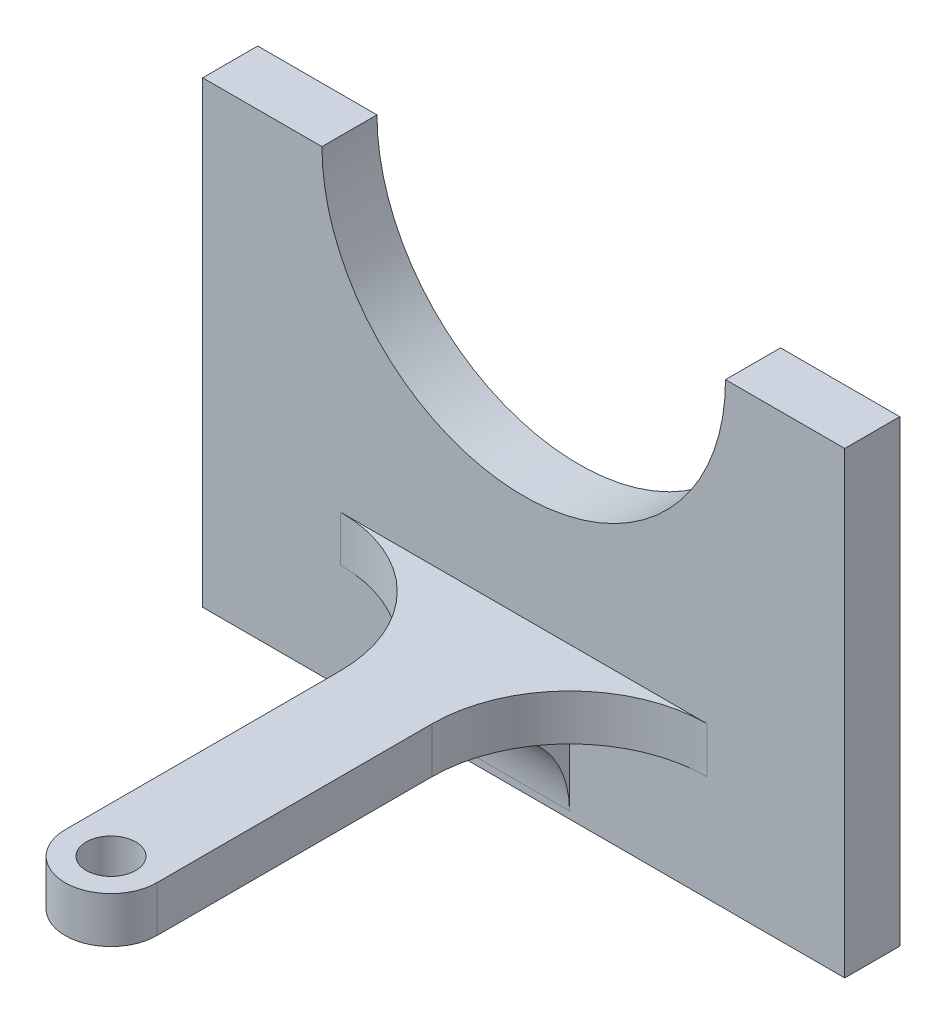
ISO-10303-21;
HEADER;
FILE_DESCRIPTION(('STEP AP214'),'2;1');
FILE_NAME('part.step','',(''),(''),'','','');
FILE_SCHEMA(('AUTOMOTIVE_DESIGN { 1 0 10303 214 1 1 1 1 }'));
ENDSEC;
DATA;
#1=APPLICATION_CONTEXT('core data for automotive mechanical design processes');
#2=APPLICATION_PROTOCOL_DEFINITION('international standard','automotive_design',2000,#1);
#3=PRODUCT_CONTEXT('',#1,'mechanical');
#4=PRODUCT('Part','Part','',(#3));
#5=PRODUCT_RELATED_PRODUCT_CATEGORY('part','',(#4));
#6=PRODUCT_DEFINITION_FORMATION('','',#4);
#7=PRODUCT_DEFINITION_CONTEXT('part definition',#1,'design');
#8=PRODUCT_DEFINITION('design','',#6,#7);
#9=PRODUCT_DEFINITION_SHAPE('','',#8);
#10=(LENGTH_UNIT() NAMED_UNIT(*) SI_UNIT(.MILLI.,.METRE.));
#11=(NAMED_UNIT(*) PLANE_ANGLE_UNIT() SI_UNIT($,.RADIAN.));
#12=(NAMED_UNIT(*) SI_UNIT($,.STERADIAN.) SOLID_ANGLE_UNIT());
#13=UNCERTAINTY_MEASURE_WITH_UNIT(LENGTH_MEASURE(1.E-05),#10,'distance_accuracy_value','');
#14=(GEOMETRIC_REPRESENTATION_CONTEXT(3) GLOBAL_UNCERTAINTY_ASSIGNED_CONTEXT((#13)) GLOBAL_UNIT_ASSIGNED_CONTEXT((#10,
#11,#12)) REPRESENTATION_CONTEXT('',''));
#15=CARTESIAN_POINT('',(0.,0.,0.));
#16=DIRECTION('',(0.,0.,1.));
#17=DIRECTION('',(1.,0.,0.));
#18=AXIS2_PLACEMENT_3D('',#15,#16,#17);
#19=CARTESIAN_POINT('',(0.,0.,4.));
#20=DIRECTION('',(0.,0.,1.));
#21=DIRECTION('',(1.,0.,0.));
#22=AXIS2_PLACEMENT_3D('',#19,#20,#21);
#23=PLANE('',#22);
#24=CARTESIAN_POINT('',(0.,25.,4.));
#25=DIRECTION('',(0.,0.,1.));
#26=DIRECTION('',(1.,0.,0.));
#27=AXIS2_PLACEMENT_3D('',#24,#25,#26);
#28=CIRCLE('',#27,22.);
#29=CARTESIAN_POINT('',(-22.,25.,4.));
#30=VERTEX_POINT('',#29);
#31=CARTESIAN_POINT('',(22.,25.,4.));
#32=VERTEX_POINT('',#31);
#33=EDGE_CURVE('E213',#30,#32,#28,.T.);
#34=ORIENTED_EDGE('',*,*,#33,.F.);
#35=DIRECTION('',(-1.,0.,0.));
#36=VECTOR('',#35,1.);
#37=CARTESIAN_POINT('',(0.,25.,4.));
#38=LINE('',#37,#36);
#39=CARTESIAN_POINT('',(-35.,25.,4.));
#40=VERTEX_POINT('',#39);
#41=EDGE_CURVE('E216',#30,#40,#38,.T.);
#42=ORIENTED_EDGE('',*,*,#41,.T.);
#43=DIRECTION('',(0.,1.,0.));
#44=VECTOR('',#43,1.);
#45=CARTESIAN_POINT('',(-35.,0.,4.));
#46=LINE('',#45,#44);
#47=CARTESIAN_POINT('',(-35.,-25.,4.));
#48=VERTEX_POINT('',#47);
#49=EDGE_CURVE('E219',#48,#40,#46,.T.);
#50=ORIENTED_EDGE('',*,*,#49,.F.);
#51=DIRECTION('',(-1.,0.,0.));
#52=VECTOR('',#51,1.);
#53=CARTESIAN_POINT('',(0.,-25.,4.));
#54=LINE('',#53,#52);
#55=CARTESIAN_POINT('',(35.,-25.,4.));
#56=VERTEX_POINT('',#55);
#57=EDGE_CURVE('E223',#56,#48,#54,.T.);
#58=ORIENTED_EDGE('',*,*,#57,.F.);
#59=DIRECTION('',(0.,1.,0.));
#60=VECTOR('',#59,1.);
#61=CARTESIAN_POINT('',(35.,0.,4.));
#62=LINE('',#61,#60);
#63=CARTESIAN_POINT('',(35.,25.,4.));
#64=VERTEX_POINT('',#63);
#65=EDGE_CURVE('E226',#56,#64,#62,.T.);
#66=ORIENTED_EDGE('',*,*,#65,.T.);
#67=EDGE_CURVE('E220',#64,#32,#38,.T.);
#68=ORIENTED_EDGE('',*,*,#67,.T.);
#69=EDGE_LOOP('',(#34,#42,#50,#58,#66,#68));
#70=FACE_BOUND('',#69,.T.);
#71=DIRECTION('',(1.,0.,0.));
#72=VECTOR('',#71,1.);
#73=CARTESIAN_POINT('',(-5.,-24.2336891325278,4.));
#74=LINE('',#73,#72);
#75=CARTESIAN_POINT('',(-5.,-24.2336891325278,4.));
#76=VERTEX_POINT('',#75);
#77=CARTESIAN_POINT('',(5.,-24.2336891325278,4.));
#78=VERTEX_POINT('',#77);
#79=EDGE_CURVE('E147',#76,#78,#74,.T.);
#80=ORIENTED_EDGE('',*,*,#79,.F.);
#81=DIRECTION('',(0.,-1.,0.));
#82=VECTOR('',#81,1.);
#83=CARTESIAN_POINT('',(-5.,0.,4.));
#84=LINE('',#83,#82);
#85=CARTESIAN_POINT('',(-5.,-13.5,4.));
#86=VERTEX_POINT('',#85);
#87=EDGE_CURVE('E168',#86,#76,#84,.T.);
#88=ORIENTED_EDGE('',*,*,#87,.F.);
#89=DIRECTION('',(1.,0.,0.));
#90=VECTOR('',#89,1.);
#91=CARTESIAN_POINT('',(5.,-13.5,4.));
#92=LINE('',#91,#90);
#93=CARTESIAN_POINT('',(-20.,-13.5,4.));
#94=VERTEX_POINT('',#93);
#95=EDGE_CURVE('E198',#94,#86,#92,.T.);
#96=ORIENTED_EDGE('',*,*,#95,.F.);
#97=DIRECTION('',(0.,-1.,0.));
#98=VECTOR('',#97,1.);
#99=CARTESIAN_POINT('',(-20.,-8.5,4.));
#100=LINE('',#99,#98);
#101=CARTESIAN_POINT('',(-20.,-8.5,4.));
#102=VERTEX_POINT('',#101);
#103=EDGE_CURVE('E179',#102,#94,#100,.T.);
#104=ORIENTED_EDGE('',*,*,#103,.F.);
#105=DIRECTION('',(-1.,0.,0.));
#106=VECTOR('',#105,1.);
#107=CARTESIAN_POINT('',(5.,-8.5,4.));
#108=LINE('',#107,#106);
#109=CARTESIAN_POINT('',(20.,-8.5,4.));
#110=VERTEX_POINT('',#109);
#111=EDGE_CURVE('E61',#110,#102,#108,.T.);
#112=ORIENTED_EDGE('',*,*,#111,.F.);
#113=DIRECTION('',(0.,-1.,0.));
#114=VECTOR('',#113,1.);
#115=CARTESIAN_POINT('',(20.,-8.5,4.));
#116=LINE('',#115,#114);
#117=CARTESIAN_POINT('',(20.,-13.5,4.));
#118=VERTEX_POINT('',#117);
#119=EDGE_CURVE('E186',#110,#118,#116,.T.);
#120=ORIENTED_EDGE('',*,*,#119,.T.);
#121=CARTESIAN_POINT('',(5.,-13.5,4.));
#122=VERTEX_POINT('',#121);
#123=EDGE_CURVE('E163',#122,#118,#92,.T.);
#124=ORIENTED_EDGE('',*,*,#123,.F.);
#125=DIRECTION('',(0.,-1.,0.));
#126=VECTOR('',#125,1.);
#127=CARTESIAN_POINT('',(5.,0.,4.));
#128=LINE('',#127,#126);
#129=EDGE_CURVE('E53',#122,#78,#128,.T.);
#130=ORIENTED_EDGE('',*,*,#129,.T.);
#131=EDGE_LOOP('',(#80,#88,#96,#104,#112,#120,#124,#130));
#132=FACE_BOUND('',#131,.T.);
#133=ADVANCED_FACE('F37',(#70,#132),#23,.T.);
#134=CARTESIAN_POINT('',(5.,-13.5,54.));
#135=DIRECTION('',(0.,1.,0.));
#136=DIRECTION('',(0.,0.,1.));
#137=AXIS2_PLACEMENT_3D('',#134,#135,#136);
#138=PLANE('',#137);
#139=CARTESIAN_POINT('',(0.,-13.5,49.));
#140=DIRECTION('',(0.,1.,0.));
#141=DIRECTION('',(0.,0.,1.));
#142=AXIS2_PLACEMENT_3D('',#139,#140,#141);
#143=CIRCLE('',#142,2.7);
#144=CARTESIAN_POINT('',(0.,-13.5,51.7));
#145=VERTEX_POINT('',#144);
#146=EDGE_CURVE('E195',#145,#145,#143,.T.);
#147=ORIENTED_EDGE('',*,*,#146,.T.);
#148=EDGE_LOOP('',(#147));
#149=FACE_BOUND('',#148,.T.);
#150=DIRECTION('',(0.,0.,-1.));
#151=VECTOR('',#150,1.);
#152=CARTESIAN_POINT('',(-5.,-13.5,0.));
#153=LINE('',#152,#151);
#154=CARTESIAN_POINT('',(-5.,-13.5,13.1902442393469));
#155=VERTEX_POINT('',#154);
#156=EDGE_CURVE('E155',#155,#86,#153,.T.);
#157=ORIENTED_EDGE('',*,*,#156,.F.);
#158=DIRECTION('',(1.,0.,0.));
#159=VECTOR('',#158,1.);
#160=CARTESIAN_POINT('',(-5.,-13.5,13.1902442393469));
#161=LINE('',#160,#159);
#162=CARTESIAN_POINT('',(5.,-13.5,13.1902442393469));
#163=VERTEX_POINT('',#162);
#164=EDGE_CURVE('E154',#155,#163,#161,.T.);
#165=ORIENTED_EDGE('',*,*,#164,.T.);
#166=DIRECTION('',(0.,0.,-1.));
#167=VECTOR('',#166,1.);
#168=CARTESIAN_POINT('',(5.,-13.5,0.));
#169=LINE('',#168,#167);
#170=EDGE_CURVE('E158',#163,#122,#169,.T.);
#171=ORIENTED_EDGE('',*,*,#170,.T.);
#172=ORIENTED_EDGE('',*,*,#123,.T.);
#173=CARTESIAN_POINT('',(20.,-13.5,19.));
#174=DIRECTION('',(0.,1.,0.));
#175=DIRECTION('',(0.,0.,1.));
#176=AXIS2_PLACEMENT_3D('',#173,#174,#175);
#177=CIRCLE('',#176,15.);
#178=CARTESIAN_POINT('',(5.,-13.5,19.));
#179=VERTEX_POINT('',#178);
#180=EDGE_CURVE('E182',#118,#179,#177,.T.);
#181=ORIENTED_EDGE('',*,*,#180,.T.);
#182=DIRECTION('',(0.,0.,-1.));
#183=VECTOR('',#182,1.);
#184=CARTESIAN_POINT('',(5.,-13.5,54.));
#185=LINE('',#184,#183);
#186=CARTESIAN_POINT('',(5.,-13.5,49.));
#187=VERTEX_POINT('',#186);
#188=EDGE_CURVE('E207',#187,#179,#185,.T.);
#189=ORIENTED_EDGE('',*,*,#188,.F.);
#190=CARTESIAN_POINT('',(0.,-13.5,49.));
#191=DIRECTION('',(0.,1.,0.));
#192=DIRECTION('',(0.,0.,1.));
#193=AXIS2_PLACEMENT_3D('',#190,#191,#192);
#194=CIRCLE('',#193,5.);
#195=CARTESIAN_POINT('',(-5.,-13.5,49.));
#196=VERTEX_POINT('',#195);
#197=EDGE_CURVE('E11',#187,#196,#194,.F.);
#198=ORIENTED_EDGE('',*,*,#197,.T.);
#199=DIRECTION('',(0.,0.,-1.));
#200=VECTOR('',#199,1.);
#201=CARTESIAN_POINT('',(-5.,-13.5,54.));
#202=LINE('',#201,#200);
#203=CARTESIAN_POINT('',(-5.,-13.5,19.));
#204=VERTEX_POINT('',#203);
#205=EDGE_CURVE('E210',#196,#204,#202,.T.);
#206=ORIENTED_EDGE('',*,*,#205,.T.);
#207=CARTESIAN_POINT('',(-20.,-13.5,19.));
#208=DIRECTION('',(0.,1.,0.));
#209=DIRECTION('',(0.,0.,-1.));
#210=AXIS2_PLACEMENT_3D('',#207,#208,#209);
#211=CIRCLE('',#210,15.);
#212=EDGE_CURVE('E171',#204,#94,#211,.T.);
#213=ORIENTED_EDGE('',*,*,#212,.T.);
#214=ORIENTED_EDGE('',*,*,#95,.T.);
#215=EDGE_LOOP('',(#157,#165,#171,#172,#181,#189,#198,#206,#213,#214));
#216=FACE_BOUND('',#215,.T.);
#217=ADVANCED_FACE('F275',(#149,#216),#138,.F.);
#218=CARTESIAN_POINT('',(-5.,-8.5,54.));
#219=DIRECTION('',(1.,0.,0.));
#220=DIRECTION('',(0.,0.,-1.));
#221=AXIS2_PLACEMENT_3D('',#218,#219,#220);
#222=PLANE('',#221);
#223=DIRECTION('',(0.,-1.,0.));
#224=VECTOR('',#223,1.);
#225=CARTESIAN_POINT('',(-5.,-8.5,19.));
#226=LINE('',#225,#224);
#227=CARTESIAN_POINT('',(-5.,-8.5,19.));
#228=VERTEX_POINT('',#227);
#229=EDGE_CURVE('E176',#228,#204,#226,.T.);
#230=ORIENTED_EDGE('',*,*,#229,.T.);
#231=ORIENTED_EDGE('',*,*,#205,.F.);
#232=DIRECTION('',(0.,1.,0.));
#233=VECTOR('',#232,1.);
#234=CARTESIAN_POINT('',(-5.,-8.5,49.));
#235=LINE('',#234,#233);
#236=CARTESIAN_POINT('',(-5.,-8.5,49.));
#237=VERTEX_POINT('',#236);
#238=EDGE_CURVE('E257',#196,#237,#235,.T.);
#239=ORIENTED_EDGE('',*,*,#238,.T.);
#240=DIRECTION('',(0.,0.,-1.));
#241=VECTOR('',#240,1.);
#242=CARTESIAN_POINT('',(-5.,-8.5,54.));
#243=LINE('',#242,#241);
#244=EDGE_CURVE('E202',#237,#228,#243,.T.);
#245=ORIENTED_EDGE('',*,*,#244,.T.);
#246=EDGE_LOOP('',(#230,#231,#239,#245));
#247=FACE_BOUND('',#246,.T.);
#248=ADVANCED_FACE('F284',(#247),#222,.F.);
#249=CARTESIAN_POINT('',(0.,-8.5,49.));
#250=DIRECTION('',(0.,1.,0.));
#251=DIRECTION('',(-1.,0.,0.));
#252=AXIS2_PLACEMENT_3D('',#249,#250,#251);
#253=CYLINDRICAL_SURFACE('',#252,5.);
#254=DIRECTION('',(0.,1.,0.));
#255=VECTOR('',#254,1.);
#256=CARTESIAN_POINT('',(5.,-8.5,49.));
#257=LINE('',#256,#255);
#258=CARTESIAN_POINT('',(5.,-8.5,49.));
#259=VERTEX_POINT('',#258);
#260=EDGE_CURVE('E244',#259,#187,#257,.F.);
#261=ORIENTED_EDGE('',*,*,#260,.F.);
#262=CARTESIAN_POINT('',(0.,-8.5,49.));
#263=DIRECTION('',(0.,-1.,0.));
#264=DIRECTION('',(0.,0.,-1.));
#265=AXIS2_PLACEMENT_3D('',#262,#263,#264);
#266=CIRCLE('',#265,5.);
#267=EDGE_CURVE('E46',#237,#259,#266,.F.);
#268=ORIENTED_EDGE('',*,*,#267,.F.);
#269=ORIENTED_EDGE('',*,*,#238,.F.);
#270=ORIENTED_EDGE('',*,*,#197,.F.);
#271=EDGE_LOOP('',(#261,#268,#269,#270));
#272=FACE_BOUND('',#271,.T.);
#273=ADVANCED_FACE('F40',(#272),#253,.T.);
#274=CARTESIAN_POINT('',(0.,25.,-2.));
#275=DIRECTION('',(0.,0.,1.));
#276=DIRECTION('',(1.,0.,0.));
#277=AXIS2_PLACEMENT_3D('',#274,#275,#276);
#278=CYLINDRICAL_SURFACE('',#277,22.);
#279=DIRECTION('',(0.,0.,1.));
#280=VECTOR('',#279,1.);
#281=CARTESIAN_POINT('',(-22.,25.,-2.));
#282=LINE('',#281,#280);
#283=CARTESIAN_POINT('',(-22.,25.,-2.));
#284=VERTEX_POINT('',#283);
#285=EDGE_CURVE('E253',#284,#30,#282,.T.);
#286=ORIENTED_EDGE('',*,*,#285,.T.);
#287=ORIENTED_EDGE('',*,*,#33,.T.);
#288=DIRECTION('',(0.,0.,1.));
#289=VECTOR('',#288,1.);
#290=CARTESIAN_POINT('',(22.,25.,-2.));
#291=LINE('',#290,#289);
#292=CARTESIAN_POINT('',(22.,25.,-2.));
#293=VERTEX_POINT('',#292);
#294=EDGE_CURVE('E242',#293,#32,#291,.T.);
#295=ORIENTED_EDGE('',*,*,#294,.F.);
#296=CARTESIAN_POINT('',(0.,25.,-2.));
#297=DIRECTION('',(0.,0.,1.));
#298=DIRECTION('',(1.,0.,0.));
#299=AXIS2_PLACEMENT_3D('',#296,#297,#298);
#300=CIRCLE('',#299,22.);
#301=EDGE_CURVE('E229',#284,#293,#300,.T.);
#302=ORIENTED_EDGE('',*,*,#301,.F.);
#303=EDGE_LOOP('',(#286,#287,#295,#302));
#304=FACE_BOUND('',#303,.T.);
#305=ADVANCED_FACE('F291',(#304),#278,.F.);
#306=CARTESIAN_POINT('',(0.,25.,-2.));
#307=DIRECTION('',(0.,1.,0.));
#308=DIRECTION('',(0.,0.,1.));
#309=AXIS2_PLACEMENT_3D('',#306,#307,#308);
#310=PLANE('',#309);
#311=ORIENTED_EDGE('',*,*,#294,.T.);
#312=ORIENTED_EDGE('',*,*,#67,.F.);
#313=DIRECTION('',(0.,0.,1.));
#314=VECTOR('',#313,1.);
#315=CARTESIAN_POINT('',(35.,25.,-2.));
#316=LINE('',#315,#314);
#317=CARTESIAN_POINT('',(35.,25.,-2.));
#318=VERTEX_POINT('',#317);
#319=EDGE_CURVE('E245',#318,#64,#316,.T.);
#320=ORIENTED_EDGE('',*,*,#319,.F.);
#321=DIRECTION('',(-1.,0.,0.));
#322=VECTOR('',#321,1.);
#323=CARTESIAN_POINT('',(0.,25.,-2.));
#324=LINE('',#323,#322);
#325=EDGE_CURVE('E235',#318,#293,#324,.T.);
#326=ORIENTED_EDGE('',*,*,#325,.T.);
#327=EDGE_LOOP('',(#311,#312,#320,#326));
#328=FACE_BOUND('',#327,.T.);
#329=ADVANCED_FACE('F306',(#328),#310,.T.);
#330=CARTESIAN_POINT('',(35.,0.,-2.));
#331=DIRECTION('',(1.,0.,0.));
#332=DIRECTION('',(0.,0.,-1.));
#333=AXIS2_PLACEMENT_3D('',#330,#331,#332);
#334=PLANE('',#333);
#335=ORIENTED_EDGE('',*,*,#319,.T.);
#336=ORIENTED_EDGE('',*,*,#65,.F.);
#337=DIRECTION('',(0.,0.,1.));
#338=VECTOR('',#337,1.);
#339=CARTESIAN_POINT('',(35.,-25.,-2.));
#340=LINE('',#339,#338);
#341=CARTESIAN_POINT('',(35.,-25.,-2.));
#342=VERTEX_POINT('',#341);
#343=EDGE_CURVE('E247',#342,#56,#340,.T.);
#344=ORIENTED_EDGE('',*,*,#343,.F.);
#345=DIRECTION('',(0.,1.,0.));
#346=VECTOR('',#345,1.);
#347=CARTESIAN_POINT('',(35.,0.,-2.));
#348=LINE('',#347,#346);
#349=EDGE_CURVE('E239',#342,#318,#348,.T.);
#350=ORIENTED_EDGE('',*,*,#349,.T.);
#351=EDGE_LOOP('',(#335,#336,#344,#350));
#352=FACE_BOUND('',#351,.T.);
#353=ADVANCED_FACE('F309',(#352),#334,.T.);
#354=CARTESIAN_POINT('',(0.,-25.,-2.));
#355=DIRECTION('',(0.,1.,0.));
#356=DIRECTION('',(-1.,0.,0.));
#357=AXIS2_PLACEMENT_3D('',#354,#355,#356);
#358=PLANE('',#357);
#359=ORIENTED_EDGE('',*,*,#343,.T.);
#360=ORIENTED_EDGE('',*,*,#57,.T.);
#361=DIRECTION('',(0.,0.,1.));
#362=VECTOR('',#361,1.);
#363=CARTESIAN_POINT('',(-35.,-25.,-2.));
#364=LINE('',#363,#362);
#365=CARTESIAN_POINT('',(-35.,-25.,-2.));
#366=VERTEX_POINT('',#365);
#367=EDGE_CURVE('E249',#366,#48,#364,.T.);
#368=ORIENTED_EDGE('',*,*,#367,.F.);
#369=DIRECTION('',(-1.,0.,0.));
#370=VECTOR('',#369,1.);
#371=CARTESIAN_POINT('',(0.,-25.,-2.));
#372=LINE('',#371,#370);
#373=EDGE_CURVE('E237',#342,#366,#372,.T.);
#374=ORIENTED_EDGE('',*,*,#373,.F.);
#375=EDGE_LOOP('',(#359,#360,#368,#374));
#376=FACE_BOUND('',#375,.T.);
#377=ADVANCED_FACE('F313',(#376),#358,.F.);
#378=CARTESIAN_POINT('',(-35.,0.,-2.));
#379=DIRECTION('',(1.,0.,0.));
#380=DIRECTION('',(0.,0.,-1.));
#381=AXIS2_PLACEMENT_3D('',#378,#379,#380);
#382=PLANE('',#381);
#383=ORIENTED_EDGE('',*,*,#367,.T.);
#384=ORIENTED_EDGE('',*,*,#49,.T.);
#385=DIRECTION('',(0.,0.,1.));
#386=VECTOR('',#385,1.);
#387=CARTESIAN_POINT('',(-35.,25.,-2.));
#388=LINE('',#387,#386);
#389=CARTESIAN_POINT('',(-35.,25.,-2.));
#390=VERTEX_POINT('',#389);
#391=EDGE_CURVE('E251',#390,#40,#388,.T.);
#392=ORIENTED_EDGE('',*,*,#391,.F.);
#393=DIRECTION('',(0.,1.,0.));
#394=VECTOR('',#393,1.);
#395=CARTESIAN_POINT('',(-35.,0.,-2.));
#396=LINE('',#395,#394);
#397=EDGE_CURVE('E234',#366,#390,#396,.T.);
#398=ORIENTED_EDGE('',*,*,#397,.F.);
#399=EDGE_LOOP('',(#383,#384,#392,#398));
#400=FACE_BOUND('',#399,.T.);
#401=ADVANCED_FACE('F317',(#400),#382,.F.);
#402=ORIENTED_EDGE('',*,*,#391,.T.);
#403=ORIENTED_EDGE('',*,*,#41,.F.);
#404=ORIENTED_EDGE('',*,*,#285,.F.);
#405=EDGE_CURVE('E231',#284,#390,#324,.T.);
#406=ORIENTED_EDGE('',*,*,#405,.T.);
#407=EDGE_LOOP('',(#402,#403,#404,#406));
#408=FACE_BOUND('',#407,.T.);
#409=ADVANCED_FACE('F304',(#408),#310,.T.);
#410=CARTESIAN_POINT('',(0.,0.,-2.));
#411=DIRECTION('',(0.,0.,1.));
#412=DIRECTION('',(1.,0.,0.));
#413=AXIS2_PLACEMENT_3D('',#410,#411,#412);
#414=PLANE('',#413);
#415=ORIENTED_EDGE('',*,*,#301,.T.);
#416=ORIENTED_EDGE('',*,*,#325,.F.);
#417=ORIENTED_EDGE('',*,*,#349,.F.);
#418=ORIENTED_EDGE('',*,*,#373,.T.);
#419=ORIENTED_EDGE('',*,*,#397,.T.);
#420=ORIENTED_EDGE('',*,*,#405,.F.);
#421=EDGE_LOOP('',(#415,#416,#417,#418,#419,#420));
#422=FACE_BOUND('',#421,.T.);
#423=ADVANCED_FACE('F301',(#422),#414,.F.);
#424=CARTESIAN_POINT('',(5.,-8.5,54.));
#425=DIRECTION('',(-1.,0.,0.));
#426=DIRECTION('',(0.,-1.,0.));
#427=AXIS2_PLACEMENT_3D('',#424,#425,#426);
#428=PLANE('',#427);
#429=ORIENTED_EDGE('',*,*,#188,.T.);
#430=DIRECTION('',(0.,-1.,0.));
#431=VECTOR('',#430,1.);
#432=CARTESIAN_POINT('',(5.,-8.5,19.));
#433=LINE('',#432,#431);
#434=CARTESIAN_POINT('',(5.,-8.5,19.));
#435=VERTEX_POINT('',#434);
#436=EDGE_CURVE('E189',#435,#179,#433,.T.);
#437=ORIENTED_EDGE('',*,*,#436,.F.);
#438=DIRECTION('',(0.,0.,-1.));
#439=VECTOR('',#438,1.);
#440=CARTESIAN_POINT('',(5.,-8.5,54.));
#441=LINE('',#440,#439);
#442=EDGE_CURVE('E204',#259,#435,#441,.T.);
#443=ORIENTED_EDGE('',*,*,#442,.F.);
#444=ORIENTED_EDGE('',*,*,#260,.T.);
#445=EDGE_LOOP('',(#429,#437,#443,#444));
#446=FACE_BOUND('',#445,.T.);
#447=ADVANCED_FACE('F268',(#446),#428,.F.);
#448=CARTESIAN_POINT('',(5.,-8.5,54.));
#449=DIRECTION('',(0.,-1.,0.));
#450=DIRECTION('',(0.,0.,-1.));
#451=AXIS2_PLACEMENT_3D('',#448,#449,#450);
#452=PLANE('',#451);
#453=CARTESIAN_POINT('',(0.,-8.5,49.));
#454=DIRECTION('',(0.,1.,0.));
#455=DIRECTION('',(-1.,0.,0.));
#456=AXIS2_PLACEMENT_3D('',#453,#454,#455);
#457=CIRCLE('',#456,2.7);
#458=CARTESIAN_POINT('',(-2.7,-8.5,49.));
#459=VERTEX_POINT('',#458);
#460=EDGE_CURVE('E191',#459,#459,#457,.T.);
#461=ORIENTED_EDGE('',*,*,#460,.F.);
#462=EDGE_LOOP('',(#461));
#463=FACE_BOUND('',#462,.T.);
#464=ORIENTED_EDGE('',*,*,#244,.F.);
#465=ORIENTED_EDGE('',*,*,#267,.T.);
#466=ORIENTED_EDGE('',*,*,#442,.T.);
#467=CARTESIAN_POINT('',(20.,-8.5,19.));
#468=DIRECTION('',(0.,1.,0.));
#469=DIRECTION('',(0.,0.,1.));
#470=AXIS2_PLACEMENT_3D('',#467,#468,#469);
#471=CIRCLE('',#470,15.);
#472=EDGE_CURVE('E184',#110,#435,#471,.T.);
#473=ORIENTED_EDGE('',*,*,#472,.F.);
#474=ORIENTED_EDGE('',*,*,#111,.T.);
#475=CARTESIAN_POINT('',(-20.,-8.5,19.));
#476=DIRECTION('',(0.,1.,0.));
#477=DIRECTION('',(0.,0.,-1.));
#478=AXIS2_PLACEMENT_3D('',#475,#476,#477);
#479=CIRCLE('',#478,15.);
#480=EDGE_CURVE('E173',#228,#102,#479,.T.);
#481=ORIENTED_EDGE('',*,*,#480,.F.);
#482=EDGE_LOOP('',(#464,#465,#466,#473,#474,#481));
#483=FACE_BOUND('',#482,.T.);
#484=ADVANCED_FACE('F261',(#463,#483),#452,.F.);
#485=CARTESIAN_POINT('',(0.,-43.5,49.));
#486=DIRECTION('',(0.,1.,0.));
#487=DIRECTION('',(-1.,0.,0.));
#488=AXIS2_PLACEMENT_3D('',#485,#486,#487);
#489=CYLINDRICAL_SURFACE('',#488,2.7);
#490=ORIENTED_EDGE('',*,*,#460,.T.);
#491=EDGE_LOOP('',(#490));
#492=FACE_BOUND('',#491,.T.);
#493=ORIENTED_EDGE('',*,*,#146,.F.);
#494=EDGE_LOOP('',(#493));
#495=FACE_BOUND('',#494,.T.);
#496=ADVANCED_FACE('F364',(#492,#495),#489,.F.);
#497=CARTESIAN_POINT('',(20.,-8.5,19.));
#498=DIRECTION('',(0.,-1.,0.));
#499=DIRECTION('',(0.,0.,-1.));
#500=AXIS2_PLACEMENT_3D('',#497,#498,#499);
#501=CYLINDRICAL_SURFACE('',#500,15.);
#502=ORIENTED_EDGE('',*,*,#180,.F.);
#503=ORIENTED_EDGE('',*,*,#119,.F.);
#504=ORIENTED_EDGE('',*,*,#472,.T.);
#505=ORIENTED_EDGE('',*,*,#436,.T.);
#506=EDGE_LOOP('',(#502,#503,#504,#505));
#507=FACE_BOUND('',#506,.T.);
#508=ADVANCED_FACE('F271',(#507),#501,.F.);
#509=CARTESIAN_POINT('',(-20.,-8.5,19.));
#510=DIRECTION('',(0.,-1.,0.));
#511=DIRECTION('',(0.,0.,-1.));
#512=AXIS2_PLACEMENT_3D('',#509,#510,#511);
#513=CYLINDRICAL_SURFACE('',#512,15.);
#514=ORIENTED_EDGE('',*,*,#212,.F.);
#515=ORIENTED_EDGE('',*,*,#229,.F.);
#516=ORIENTED_EDGE('',*,*,#480,.T.);
#517=ORIENTED_EDGE('',*,*,#103,.T.);
#518=EDGE_LOOP('',(#514,#515,#516,#517));
#519=FACE_BOUND('',#518,.T.);
#520=ADVANCED_FACE('F280',(#519),#513,.F.);
#521=CARTESIAN_POINT('',(-5.,-24.350208175391,14.9993828605359));
#522=DIRECTION('',(1.,0.,0.));
#523=DIRECTION('',(0.,0.,-1.));
#524=AXIS2_PLACEMENT_3D('',#521,#522,#523);
#525=CYLINDRICAL_SURFACE('',#524,11.);
#526=ORIENTED_EDGE('',*,*,#79,.T.);
#527=CARTESIAN_POINT('',(5.,-24.350208175391,14.9993828605359));
#528=DIRECTION('',(1.,0.,0.));
#529=DIRECTION('',(0.,0.,-1.));
#530=AXIS2_PLACEMENT_3D('',#527,#528,#529);
#531=CIRCLE('',#530,11.);
#532=EDGE_CURVE('E150',#78,#163,#531,.T.);
#533=ORIENTED_EDGE('',*,*,#532,.T.);
#534=ORIENTED_EDGE('',*,*,#164,.F.);
#535=CARTESIAN_POINT('',(-5.,-24.350208175391,14.9993828605359));
#536=DIRECTION('',(1.,0.,0.));
#537=DIRECTION('',(0.,0.,-1.));
#538=AXIS2_PLACEMENT_3D('',#535,#536,#537);
#539=CIRCLE('',#538,11.);
#540=EDGE_CURVE('E151',#76,#155,#539,.T.);
#541=ORIENTED_EDGE('',*,*,#540,.F.);
#542=EDGE_LOOP('',(#526,#533,#534,#541));
#543=FACE_BOUND('',#542,.T.);
#544=ADVANCED_FACE('F148',(#543),#525,.F.);
#545=CARTESIAN_POINT('',(-5.,0.,0.));
#546=DIRECTION('',(1.,0.,0.));
#547=DIRECTION('',(0.,0.,-1.));
#548=AXIS2_PLACEMENT_3D('',#545,#546,#547);
#549=PLANE('',#548);
#550=ORIENTED_EDGE('',*,*,#540,.T.);
#551=ORIENTED_EDGE('',*,*,#156,.T.);
#552=ORIENTED_EDGE('',*,*,#87,.T.);
#553=EDGE_LOOP('',(#550,#551,#552));
#554=FACE_BOUND('',#553,.T.);
#555=ADVANCED_FACE('F277',(#554),#549,.F.);
#556=CARTESIAN_POINT('',(5.,0.,0.));
#557=DIRECTION('',(1.,0.,0.));
#558=DIRECTION('',(0.,0.,-1.));
#559=AXIS2_PLACEMENT_3D('',#556,#557,#558);
#560=PLANE('',#559);
#561=ORIENTED_EDGE('',*,*,#532,.F.);
#562=ORIENTED_EDGE('',*,*,#129,.F.);
#563=ORIENTED_EDGE('',*,*,#170,.F.);
#564=EDGE_LOOP('',(#561,#562,#563));
#565=FACE_BOUND('',#564,.T.);
#566=ADVANCED_FACE('F157',(#565),#560,.T.);
#567=CLOSED_SHELL('',(#133,#217,#248,#273,#305,#329,#353,#377,#401,#409,#423,#447,#484,#496,
#508,#520,#544,#555,#566));
#568=MANIFOLD_SOLID_BREP('B2',#567);
#569=ADVANCED_BREP_SHAPE_REPRESENTATION('',(#18,#568),#14);
#570=SHAPE_DEFINITION_REPRESENTATION(#9,#569);
ENDSEC;
END-ISO-10303-21;
